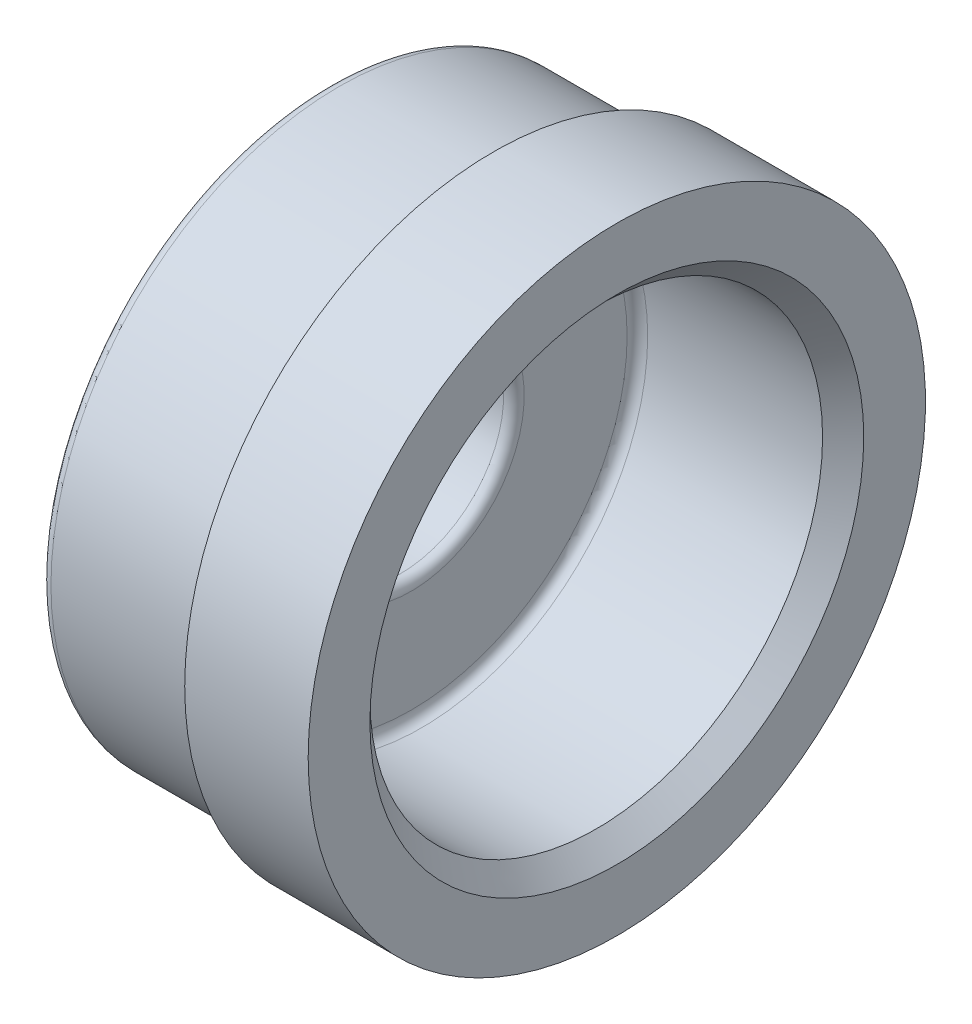
ISO-10303-21;
HEADER;
FILE_DESCRIPTION(('STEP AP214'),'2;1');
FILE_NAME('part.step','',(''),(''),'','','');
FILE_SCHEMA(('AUTOMOTIVE_DESIGN { 1 0 10303 214 1 1 1 1 }'));
ENDSEC;
DATA;
#1=APPLICATION_CONTEXT('core data for automotive mechanical design processes');
#2=APPLICATION_PROTOCOL_DEFINITION('international standard','automotive_design',2000,#1);
#3=PRODUCT_CONTEXT('',#1,'mechanical');
#4=PRODUCT('Part','Part','',(#3));
#5=PRODUCT_RELATED_PRODUCT_CATEGORY('part','',(#4));
#6=PRODUCT_DEFINITION_FORMATION('','',#4);
#7=PRODUCT_DEFINITION_CONTEXT('part definition',#1,'design');
#8=PRODUCT_DEFINITION('design','',#6,#7);
#9=PRODUCT_DEFINITION_SHAPE('','',#8);
#10=(LENGTH_UNIT() NAMED_UNIT(*) SI_UNIT(.MILLI.,.METRE.));
#11=(NAMED_UNIT(*) PLANE_ANGLE_UNIT() SI_UNIT($,.RADIAN.));
#12=(NAMED_UNIT(*) SI_UNIT($,.STERADIAN.) SOLID_ANGLE_UNIT());
#13=UNCERTAINTY_MEASURE_WITH_UNIT(LENGTH_MEASURE(1.E-05),#10,'distance_accuracy_value','');
#14=(GEOMETRIC_REPRESENTATION_CONTEXT(3) GLOBAL_UNCERTAINTY_ASSIGNED_CONTEXT((#13)) GLOBAL_UNIT_ASSIGNED_CONTEXT((#10,
#11,#12)) REPRESENTATION_CONTEXT('',''));
#15=CARTESIAN_POINT('',(0.,0.,0.));
#16=DIRECTION('',(0.,0.,1.));
#17=DIRECTION('',(1.,0.,0.));
#18=AXIS2_PLACEMENT_3D('',#15,#16,#17);
#19=CARTESIAN_POINT('',(0.,11.,0.));
#20=DIRECTION('',(-1.,0.,0.));
#21=DIRECTION('',(0.,0.,1.));
#22=AXIS2_PLACEMENT_3D('',#19,#20,#21);
#23=PLANE('',#22);
#24=CARTESIAN_POINT('',(0.,0.,0.));
#25=DIRECTION('',(-1.,0.,0.));
#26=DIRECTION('',(0.,0.,1.));
#27=AXIS2_PLACEMENT_3D('',#24,#25,#26);
#28=CIRCLE('',#27,5.5);
#29=CARTESIAN_POINT('',(0.,0.,5.5));
#30=VERTEX_POINT('',#29);
#31=EDGE_CURVE('E61',#30,#30,#28,.T.);
#32=ORIENTED_EDGE('',*,*,#31,.T.);
#33=EDGE_LOOP('',(#32));
#34=FACE_BOUND('',#33,.T.);
#35=CARTESIAN_POINT('',(0.,0.,0.));
#36=DIRECTION('',(-1.,0.,0.));
#37=DIRECTION('',(0.,0.,1.));
#38=AXIS2_PLACEMENT_3D('',#35,#36,#37);
#39=CIRCLE('',#38,10.5);
#40=CARTESIAN_POINT('',(0.,0.,10.5));
#41=VERTEX_POINT('',#40);
#42=EDGE_CURVE('E66',#41,#41,#39,.F.);
#43=ORIENTED_EDGE('',*,*,#42,.T.);
#44=EDGE_LOOP('',(#43));
#45=FACE_BOUND('',#44,.T.);
#46=ADVANCED_FACE('F46',(#34,#45),#23,.F.);
#47=CARTESIAN_POINT('',(-5.99538106235566,0.,0.));
#48=DIRECTION('',(-1.,0.,0.));
#49=DIRECTION('',(0.,0.,1.));
#50=AXIS2_PLACEMENT_3D('',#47,#48,#49);
#51=CYLINDRICAL_SURFACE('',#50,11.);
#52=CARTESIAN_POINT('',(9.,0.,0.));
#53=DIRECTION('',(-1.,0.,0.));
#54=DIRECTION('',(0.,0.,1.));
#55=AXIS2_PLACEMENT_3D('',#52,#53,#54);
#56=CIRCLE('',#55,11.);
#57=CARTESIAN_POINT('',(9.,0.,11.));
#58=VERTEX_POINT('',#57);
#59=EDGE_CURVE('E12',#58,#58,#56,.F.);
#60=ORIENTED_EDGE('',*,*,#59,.T.);
#61=EDGE_LOOP('',(#60));
#62=FACE_BOUND('',#61,.T.);
#63=CARTESIAN_POINT('',(0.5,0.,0.));
#64=DIRECTION('',(-1.,0.,0.));
#65=DIRECTION('',(0.,0.,1.));
#66=AXIS2_PLACEMENT_3D('',#63,#64,#65);
#67=CIRCLE('',#66,11.);
#68=CARTESIAN_POINT('',(0.5,0.,11.));
#69=VERTEX_POINT('',#68);
#70=EDGE_CURVE('E57',#69,#69,#67,.T.);
#71=ORIENTED_EDGE('',*,*,#70,.T.);
#72=EDGE_LOOP('',(#71));
#73=FACE_BOUND('',#72,.T.);
#74=ADVANCED_FACE('F110',(#62,#73),#51,.F.);
#75=CARTESIAN_POINT('',(10.,14.,0.));
#76=DIRECTION('',(-1.,0.,0.));
#77=DIRECTION('',(0.,0.,1.));
#78=AXIS2_PLACEMENT_3D('',#75,#76,#77);
#79=PLANE('',#78);
#80=CARTESIAN_POINT('',(10.,0.,0.));
#81=DIRECTION('',(-1.,0.,0.));
#82=DIRECTION('',(0.,0.,1.));
#83=AXIS2_PLACEMENT_3D('',#80,#81,#82);
#84=CIRCLE('',#83,12.);
#85=CARTESIAN_POINT('',(10.,0.,12.));
#86=VERTEX_POINT('',#85);
#87=EDGE_CURVE('E53',#86,#86,#84,.T.);
#88=ORIENTED_EDGE('',*,*,#87,.T.);
#89=EDGE_LOOP('',(#88));
#90=FACE_BOUND('',#89,.T.);
#91=CARTESIAN_POINT('',(10.,0.,0.));
#92=DIRECTION('',(-1.,0.,0.));
#93=DIRECTION('',(0.,0.,1.));
#94=AXIS2_PLACEMENT_3D('',#91,#92,#93);
#95=CIRCLE('',#94,15.);
#96=CARTESIAN_POINT('',(10.,0.,15.));
#97=VERTEX_POINT('',#96);
#98=EDGE_CURVE('E84',#97,#97,#95,.T.);
#99=ORIENTED_EDGE('',*,*,#98,.F.);
#100=EDGE_LOOP('',(#99));
#101=FACE_BOUND('',#100,.T.);
#102=ADVANCED_FACE('F105',(#90,#101),#79,.F.);
#103=CARTESIAN_POINT('',(-5.99538106235566,0.,0.));
#104=DIRECTION('',(-1.,0.,0.));
#105=DIRECTION('',(0.,0.,1.));
#106=AXIS2_PLACEMENT_3D('',#103,#104,#105);
#107=CYLINDRICAL_SURFACE('',#106,15.);
#108=CARTESIAN_POINT('',(4.,0.,0.));
#109=DIRECTION('',(-1.,0.,0.));
#110=DIRECTION('',(0.,0.,1.));
#111=AXIS2_PLACEMENT_3D('',#108,#109,#110);
#112=CIRCLE('',#111,15.);
#113=CARTESIAN_POINT('',(4.,0.,15.));
#114=VERTEX_POINT('',#113);
#115=EDGE_CURVE('E87',#114,#114,#112,.T.);
#116=ORIENTED_EDGE('',*,*,#115,.F.);
#117=EDGE_LOOP('',(#116));
#118=FACE_BOUND('',#117,.T.);
#119=ORIENTED_EDGE('',*,*,#98,.T.);
#120=EDGE_LOOP('',(#119));
#121=FACE_BOUND('',#120,.T.);
#122=ADVANCED_FACE('F99',(#118,#121),#107,.T.);
#123=CARTESIAN_POINT('',(4.,14.,0.));
#124=DIRECTION('',(1.,0.,0.));
#125=DIRECTION('',(0.,0.,-1.));
#126=AXIS2_PLACEMENT_3D('',#123,#124,#125);
#127=PLANE('',#126);
#128=CARTESIAN_POINT('',(4.,0.,0.));
#129=DIRECTION('',(-1.,0.,0.));
#130=DIRECTION('',(0.,0.,1.));
#131=AXIS2_PLACEMENT_3D('',#128,#129,#130);
#132=CIRCLE('',#131,14.);
#133=CARTESIAN_POINT('',(4.,0.,14.));
#134=VERTEX_POINT('',#133);
#135=EDGE_CURVE('E90',#134,#134,#132,.T.);
#136=ORIENTED_EDGE('',*,*,#135,.F.);
#137=EDGE_LOOP('',(#136));
#138=FACE_BOUND('',#137,.T.);
#139=ORIENTED_EDGE('',*,*,#115,.T.);
#140=EDGE_LOOP('',(#139));
#141=FACE_BOUND('',#140,.T.);
#142=ADVANCED_FACE('F96',(#138,#141),#127,.F.);
#143=CARTESIAN_POINT('',(-5.99538106235566,0.,0.));
#144=DIRECTION('',(-1.,0.,0.));
#145=DIRECTION('',(0.,0.,1.));
#146=AXIS2_PLACEMENT_3D('',#143,#144,#145);
#147=CYLINDRICAL_SURFACE('',#146,14.);
#148=CARTESIAN_POINT('',(-3.5,0.,0.));
#149=DIRECTION('',(1.,0.,0.));
#150=DIRECTION('',(0.,0.,-1.));
#151=AXIS2_PLACEMENT_3D('',#148,#149,#150);
#152=CIRCLE('',#151,14.);
#153=CARTESIAN_POINT('',(-3.5,0.,-14.));
#154=VERTEX_POINT('',#153);
#155=EDGE_CURVE('E75',#154,#154,#152,.T.);
#156=ORIENTED_EDGE('',*,*,#155,.T.);
#157=EDGE_LOOP('',(#156));
#158=FACE_BOUND('',#157,.T.);
#159=ORIENTED_EDGE('',*,*,#135,.T.);
#160=EDGE_LOOP('',(#159));
#161=FACE_BOUND('',#160,.T.);
#162=ADVANCED_FACE('F94',(#158,#161),#147,.T.);
#163=CARTESIAN_POINT('',(-4.,14.,0.));
#164=DIRECTION('',(1.,0.,0.));
#165=DIRECTION('',(0.,0.,-1.));
#166=AXIS2_PLACEMENT_3D('',#163,#164,#165);
#167=PLANE('',#166);
#168=CARTESIAN_POINT('',(-4.,0.,0.));
#169=DIRECTION('',(1.,0.,0.));
#170=DIRECTION('',(0.,0.,-1.));
#171=AXIS2_PLACEMENT_3D('',#168,#169,#170);
#172=CIRCLE('',#171,13.5);
#173=CARTESIAN_POINT('',(-4.,0.,-13.5));
#174=VERTEX_POINT('',#173);
#175=EDGE_CURVE('E78',#174,#174,#172,.F.);
#176=ORIENTED_EDGE('',*,*,#175,.T.);
#177=EDGE_LOOP('',(#176));
#178=FACE_BOUND('',#177,.T.);
#179=CARTESIAN_POINT('',(-4.,0.,0.));
#180=DIRECTION('',(1.,0.,0.));
#181=DIRECTION('',(0.,0.,-1.));
#182=AXIS2_PLACEMENT_3D('',#179,#180,#181);
#183=CIRCLE('',#182,5.5);
#184=CARTESIAN_POINT('',(-4.,0.,-5.5));
#185=VERTEX_POINT('',#184);
#186=EDGE_CURVE('E81',#185,#185,#183,.T.);
#187=ORIENTED_EDGE('',*,*,#186,.T.);
#188=EDGE_LOOP('',(#187));
#189=FACE_BOUND('',#188,.T.);
#190=ADVANCED_FACE('F170',(#178,#189),#167,.F.);
#191=CARTESIAN_POINT('',(-5.99538106235566,0.,0.));
#192=DIRECTION('',(-1.,0.,0.));
#193=DIRECTION('',(0.,0.,1.));
#194=AXIS2_PLACEMENT_3D('',#191,#192,#193);
#195=CYLINDRICAL_SURFACE('',#194,5.);
#196=CARTESIAN_POINT('',(-3.5,0.,0.));
#197=DIRECTION('',(1.,0.,0.));
#198=DIRECTION('',(0.,0.,-1.));
#199=AXIS2_PLACEMENT_3D('',#196,#197,#198);
#200=CIRCLE('',#199,5.);
#201=CARTESIAN_POINT('',(-3.5,0.,-5.));
#202=VERTEX_POINT('',#201);
#203=EDGE_CURVE('E69',#202,#202,#200,.F.);
#204=ORIENTED_EDGE('',*,*,#203,.T.);
#205=EDGE_LOOP('',(#204));
#206=FACE_BOUND('',#205,.T.);
#207=CARTESIAN_POINT('',(-0.5,0.,0.));
#208=DIRECTION('',(-1.,0.,0.));
#209=DIRECTION('',(0.,0.,1.));
#210=AXIS2_PLACEMENT_3D('',#207,#208,#209);
#211=CIRCLE('',#210,5.);
#212=CARTESIAN_POINT('',(-0.5,0.,5.));
#213=VERTEX_POINT('',#212);
#214=EDGE_CURVE('E72',#213,#213,#211,.F.);
#215=ORIENTED_EDGE('',*,*,#214,.T.);
#216=EDGE_LOOP('',(#215));
#217=FACE_BOUND('',#216,.T.);
#218=ADVANCED_FACE('F127',(#206,#217),#195,.F.);
#219=CARTESIAN_POINT('',(-3.5,0.,0.));
#220=DIRECTION('',(1.,0.,0.));
#221=DIRECTION('',(0.,0.,-1.));
#222=AXIS2_PLACEMENT_3D('',#219,#220,#221);
#223=TOROIDAL_SURFACE('',#222,13.5,0.5);
#224=ORIENTED_EDGE('',*,*,#155,.F.);
#225=EDGE_LOOP('',(#224));
#226=FACE_BOUND('',#225,.T.);
#227=ORIENTED_EDGE('',*,*,#175,.F.);
#228=EDGE_LOOP('',(#227));
#229=FACE_BOUND('',#228,.T.);
#230=ADVANCED_FACE('F123',(#226,#229),#223,.T.);
#231=CARTESIAN_POINT('',(-3.5,0.,0.));
#232=DIRECTION('',(1.,0.,0.));
#233=DIRECTION('',(0.,0.,-1.));
#234=AXIS2_PLACEMENT_3D('',#231,#232,#233);
#235=TOROIDAL_SURFACE('',#234,5.5,0.5);
#236=ORIENTED_EDGE('',*,*,#186,.F.);
#237=EDGE_LOOP('',(#236));
#238=FACE_BOUND('',#237,.T.);
#239=ORIENTED_EDGE('',*,*,#203,.F.);
#240=EDGE_LOOP('',(#239));
#241=FACE_BOUND('',#240,.T.);
#242=ADVANCED_FACE('F126',(#238,#241),#235,.T.);
#243=CARTESIAN_POINT('',(-0.5,0.,0.));
#244=DIRECTION('',(-1.,0.,0.));
#245=DIRECTION('',(0.,0.,1.));
#246=AXIS2_PLACEMENT_3D('',#243,#244,#245);
#247=TOROIDAL_SURFACE('',#246,5.5,0.5);
#248=ORIENTED_EDGE('',*,*,#214,.F.);
#249=EDGE_LOOP('',(#248));
#250=FACE_BOUND('',#249,.T.);
#251=ORIENTED_EDGE('',*,*,#31,.F.);
#252=EDGE_LOOP('',(#251));
#253=FACE_BOUND('',#252,.T.);
#254=ADVANCED_FACE('F131',(#250,#253),#247,.T.);
#255=CARTESIAN_POINT('',(0.5,0.,0.));
#256=DIRECTION('',(-1.,0.,0.));
#257=DIRECTION('',(0.,0.,1.));
#258=AXIS2_PLACEMENT_3D('',#255,#256,#257);
#259=TOROIDAL_SURFACE('',#258,10.5,0.5);
#260=ORIENTED_EDGE('',*,*,#42,.F.);
#261=EDGE_LOOP('',(#260));
#262=FACE_BOUND('',#261,.T.);
#263=ORIENTED_EDGE('',*,*,#70,.F.);
#264=EDGE_LOOP('',(#263));
#265=FACE_BOUND('',#264,.T.);
#266=ADVANCED_FACE('F134',(#262,#265),#259,.F.);
#267=CARTESIAN_POINT('',(10.,0.,0.));
#268=DIRECTION('',(1.,0.,0.));
#269=DIRECTION('',(0.,0.,-1.));
#270=AXIS2_PLACEMENT_3D('',#267,#268,#269);
#271=CONICAL_SURFACE('',#270,12.,0.785398163397449);
#272=ORIENTED_EDGE('',*,*,#59,.F.);
#273=EDGE_LOOP('',(#272));
#274=FACE_BOUND('',#273,.T.);
#275=ORIENTED_EDGE('',*,*,#87,.F.);
#276=EDGE_LOOP('',(#275));
#277=FACE_BOUND('',#276,.T.);
#278=ADVANCED_FACE('F48',(#274,#277),#271,.F.);
#279=CLOSED_SHELL('',(#46,#74,#102,#122,#142,#162,#190,#218,#230,#242,#254,#266,#278));
#280=MANIFOLD_SOLID_BREP('B2',#279);
#281=ADVANCED_BREP_SHAPE_REPRESENTATION('',(#18,#280),#14);
#282=SHAPE_DEFINITION_REPRESENTATION(#9,#281);
ENDSEC;
END-ISO-10303-21;
